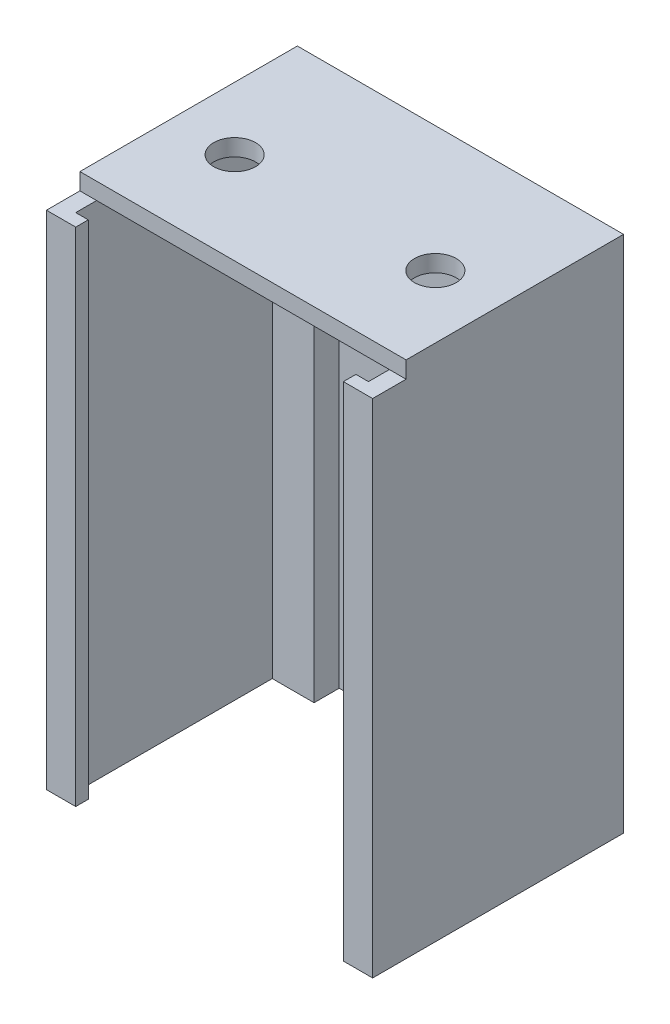
ISO-10303-21;
HEADER;
FILE_DESCRIPTION(('STEP AP214'),'2;1');
FILE_NAME('part.step','',(''),(''),'','','');
FILE_SCHEMA(('AUTOMOTIVE_DESIGN { 1 0 10303 214 1 1 1 1 }'));
ENDSEC;
DATA;
#1=APPLICATION_CONTEXT('core data for automotive mechanical design processes');
#2=APPLICATION_PROTOCOL_DEFINITION('international standard','automotive_design',2000,#1);
#3=PRODUCT_CONTEXT('',#1,'mechanical');
#4=PRODUCT('Part','Part','',(#3));
#5=PRODUCT_RELATED_PRODUCT_CATEGORY('part','',(#4));
#6=PRODUCT_DEFINITION_FORMATION('','',#4);
#7=PRODUCT_DEFINITION_CONTEXT('part definition',#1,'design');
#8=PRODUCT_DEFINITION('design','',#6,#7);
#9=PRODUCT_DEFINITION_SHAPE('','',#8);
#10=(LENGTH_UNIT() NAMED_UNIT(*) SI_UNIT(.MILLI.,.METRE.));
#11=(NAMED_UNIT(*) PLANE_ANGLE_UNIT() SI_UNIT($,.RADIAN.));
#12=(NAMED_UNIT(*) SI_UNIT($,.STERADIAN.) SOLID_ANGLE_UNIT());
#13=UNCERTAINTY_MEASURE_WITH_UNIT(LENGTH_MEASURE(1.E-05),#10,'distance_accuracy_value','');
#14=(GEOMETRIC_REPRESENTATION_CONTEXT(3) GLOBAL_UNCERTAINTY_ASSIGNED_CONTEXT((#13)) GLOBAL_UNIT_ASSIGNED_CONTEXT((#10,
#11,#12)) REPRESENTATION_CONTEXT('',''));
#15=CARTESIAN_POINT('',(0.,0.,0.));
#16=DIRECTION('',(0.,0.,1.));
#17=DIRECTION('',(1.,0.,0.));
#18=AXIS2_PLACEMENT_3D('',#15,#16,#17);
#19=CARTESIAN_POINT('',(0.,120.,0.));
#20=DIRECTION('',(0.,-1.,0.));
#21=DIRECTION('',(0.,0.,-1.));
#22=AXIS2_PLACEMENT_3D('',#19,#20,#21);
#23=PLANE('',#22);
#24=DIRECTION('',(1.,0.,0.));
#25=VECTOR('',#24,1.);
#26=CARTESIAN_POINT('',(0.,120.,52.));
#27=LINE('',#26,#25);
#28=CARTESIAN_POINT('',(0.,120.,52.));
#29=VERTEX_POINT('',#28);
#30=CARTESIAN_POINT('',(4.,120.,52.));
#31=VERTEX_POINT('',#30);
#32=EDGE_CURVE('E50',#29,#31,#27,.T.);
#33=ORIENTED_EDGE('',*,*,#32,.F.);
#34=DIRECTION('',(0.,0.,1.));
#35=VECTOR('',#34,1.);
#36=CARTESIAN_POINT('',(0.,120.,0.));
#37=LINE('',#36,#35);
#38=CARTESIAN_POINT('',(0.,120.,60.));
#39=VERTEX_POINT('',#38);
#40=EDGE_CURVE('E200',#29,#39,#37,.T.);
#41=ORIENTED_EDGE('',*,*,#40,.T.);
#42=DIRECTION('',(1.,0.,0.));
#43=VECTOR('',#42,1.);
#44=CARTESIAN_POINT('',(7.00000000000001,120.,60.));
#45=LINE('',#44,#43);
#46=CARTESIAN_POINT('',(7.00000000000001,120.,60.));
#47=VERTEX_POINT('',#46);
#48=EDGE_CURVE('E225',#39,#47,#45,.T.);
#49=ORIENTED_EDGE('',*,*,#48,.T.);
#50=DIRECTION('',(0.,0.,-1.));
#51=VECTOR('',#50,1.);
#52=CARTESIAN_POINT('',(7.00000000000001,120.,60.));
#53=LINE('',#52,#51);
#54=CARTESIAN_POINT('',(7.00000000000001,120.,57.));
#55=VERTEX_POINT('',#54);
#56=EDGE_CURVE('E229',#47,#55,#53,.T.);
#57=ORIENTED_EDGE('',*,*,#56,.T.);
#58=DIRECTION('',(-1.,0.,0.));
#59=VECTOR('',#58,1.);
#60=CARTESIAN_POINT('',(7.00000000000001,120.,57.));
#61=LINE('',#60,#59);
#62=CARTESIAN_POINT('',(3.99999999999999,120.,57.));
#63=VERTEX_POINT('',#62);
#64=EDGE_CURVE('E232',#55,#63,#61,.T.);
#65=ORIENTED_EDGE('',*,*,#64,.T.);
#66=DIRECTION('',(0.,0.,-1.));
#67=VECTOR('',#66,1.);
#68=CARTESIAN_POINT('',(3.99999999999999,120.,57.));
#69=LINE('',#68,#67);
#70=EDGE_CURVE('E235',#63,#31,#69,.T.);
#71=ORIENTED_EDGE('',*,*,#70,.T.);
#72=EDGE_LOOP('',(#33,#41,#49,#57,#65,#71));
#73=FACE_BOUND('',#72,.T.);
#74=ADVANCED_FACE('F39',(#73),#23,.F.);
#75=CARTESIAN_POINT('',(74.,120.,52.));
#76=VERTEX_POINT('',#75);
#77=CARTESIAN_POINT('',(78.,120.,52.));
#78=VERTEX_POINT('',#77);
#79=EDGE_CURVE('E11',#76,#78,#27,.T.);
#80=ORIENTED_EDGE('',*,*,#79,.F.);
#81=DIRECTION('',(0.,0.,1.));
#82=VECTOR('',#81,1.);
#83=CARTESIAN_POINT('',(74.,120.,57.));
#84=LINE('',#83,#82);
#85=CARTESIAN_POINT('',(74.,120.,57.));
#86=VERTEX_POINT('',#85);
#87=EDGE_CURVE('E258',#76,#86,#84,.T.);
#88=ORIENTED_EDGE('',*,*,#87,.T.);
#89=DIRECTION('',(-1.,0.,0.));
#90=VECTOR('',#89,1.);
#91=CARTESIAN_POINT('',(71.,120.,57.));
#92=LINE('',#91,#90);
#93=CARTESIAN_POINT('',(71.,120.,57.));
#94=VERTEX_POINT('',#93);
#95=EDGE_CURVE('E263',#86,#94,#92,.T.);
#96=ORIENTED_EDGE('',*,*,#95,.T.);
#97=DIRECTION('',(0.,0.,1.));
#98=VECTOR('',#97,1.);
#99=CARTESIAN_POINT('',(71.,120.,60.));
#100=LINE('',#99,#98);
#101=CARTESIAN_POINT('',(71.,120.,60.));
#102=VERTEX_POINT('',#101);
#103=EDGE_CURVE('E266',#94,#102,#100,.T.);
#104=ORIENTED_EDGE('',*,*,#103,.T.);
#105=DIRECTION('',(1.,0.,0.));
#106=VECTOR('',#105,1.);
#107=CARTESIAN_POINT('',(71.,120.,60.));
#108=LINE('',#107,#106);
#109=CARTESIAN_POINT('',(78.,120.,60.));
#110=VERTEX_POINT('',#109);
#111=EDGE_CURVE('E269',#102,#110,#108,.T.);
#112=ORIENTED_EDGE('',*,*,#111,.T.);
#113=DIRECTION('',(0.,0.,-1.));
#114=VECTOR('',#113,1.);
#115=CARTESIAN_POINT('',(78.,120.,0.));
#116=LINE('',#115,#114);
#117=EDGE_CURVE('E272',#110,#78,#116,.T.);
#118=ORIENTED_EDGE('',*,*,#117,.T.);
#119=EDGE_LOOP('',(#80,#88,#96,#104,#112,#118));
#120=FACE_BOUND('',#119,.T.);
#121=ADVANCED_FACE('F465',(#120),#23,.F.);
#122=CARTESIAN_POINT('',(0.,120.,0.));
#123=DIRECTION('',(1.,0.,0.));
#124=DIRECTION('',(0.,0.,-1.));
#125=AXIS2_PLACEMENT_3D('',#122,#123,#124);
#126=PLANE('',#125);
#127=DIRECTION('',(0.,0.,1.));
#128=VECTOR('',#127,1.);
#129=CARTESIAN_POINT('',(0.,0.,0.));
#130=LINE('',#129,#128);
#131=CARTESIAN_POINT('',(0.,0.,0.));
#132=VERTEX_POINT('',#131);
#133=CARTESIAN_POINT('',(0.,0.,60.));
#134=VERTEX_POINT('',#133);
#135=EDGE_CURVE('E215',#132,#134,#130,.T.);
#136=ORIENTED_EDGE('',*,*,#135,.T.);
#137=DIRECTION('',(0.,-1.,0.));
#138=VECTOR('',#137,1.);
#139=CARTESIAN_POINT('',(0.,120.,60.));
#140=LINE('',#139,#138);
#141=EDGE_CURVE('E43',#39,#134,#140,.T.);
#142=ORIENTED_EDGE('',*,*,#141,.F.);
#143=ORIENTED_EDGE('',*,*,#40,.F.);
#144=DIRECTION('',(0.,-1.,0.));
#145=VECTOR('',#144,1.);
#146=CARTESIAN_POINT('',(0.,124.,52.));
#147=LINE('',#146,#145);
#148=CARTESIAN_POINT('',(0.,124.,52.));
#149=VERTEX_POINT('',#148);
#150=EDGE_CURVE('E178',#149,#29,#147,.T.);
#151=ORIENTED_EDGE('',*,*,#150,.F.);
#152=DIRECTION('',(0.,0.,1.));
#153=VECTOR('',#152,1.);
#154=CARTESIAN_POINT('',(0.,124.,0.));
#155=LINE('',#154,#153);
#156=CARTESIAN_POINT('',(0.,124.,0.));
#157=VERTEX_POINT('',#156);
#158=EDGE_CURVE('E186',#157,#149,#155,.T.);
#159=ORIENTED_EDGE('',*,*,#158,.F.);
#160=DIRECTION('',(0.,-1.,0.));
#161=VECTOR('',#160,1.);
#162=CARTESIAN_POINT('',(0.,120.,0.));
#163=LINE('',#162,#161);
#164=EDGE_CURVE('E275',#157,#132,#163,.T.);
#165=ORIENTED_EDGE('',*,*,#164,.T.);
#166=EDGE_LOOP('',(#136,#142,#143,#151,#159,#165));
#167=FACE_BOUND('',#166,.T.);
#168=ADVANCED_FACE('F41',(#167),#126,.F.);
#169=CARTESIAN_POINT('',(7.00000000000001,120.,60.));
#170=DIRECTION('',(0.,0.,-1.));
#171=DIRECTION('',(-1.,0.,0.));
#172=AXIS2_PLACEMENT_3D('',#169,#170,#171);
#173=PLANE('',#172);
#174=DIRECTION('',(1.,0.,0.));
#175=VECTOR('',#174,1.);
#176=CARTESIAN_POINT('',(7.00000000000001,0.,60.));
#177=LINE('',#176,#175);
#178=CARTESIAN_POINT('',(7.00000000000001,0.,60.));
#179=VERTEX_POINT('',#178);
#180=EDGE_CURVE('E278',#134,#179,#177,.T.);
#181=ORIENTED_EDGE('',*,*,#180,.T.);
#182=DIRECTION('',(0.,-1.,0.));
#183=VECTOR('',#182,1.);
#184=CARTESIAN_POINT('',(7.00000000000001,120.,60.));
#185=LINE('',#184,#183);
#186=EDGE_CURVE('E375',#47,#179,#185,.T.);
#187=ORIENTED_EDGE('',*,*,#186,.F.);
#188=ORIENTED_EDGE('',*,*,#48,.F.);
#189=ORIENTED_EDGE('',*,*,#141,.T.);
#190=EDGE_LOOP('',(#181,#187,#188,#189));
#191=FACE_BOUND('',#190,.T.);
#192=ADVANCED_FACE('F386',(#191),#173,.F.);
#193=CARTESIAN_POINT('',(7.00000000000001,120.,60.));
#194=DIRECTION('',(-1.,0.,0.));
#195=DIRECTION('',(0.,0.,1.));
#196=AXIS2_PLACEMENT_3D('',#193,#194,#195);
#197=PLANE('',#196);
#198=DIRECTION('',(0.,0.,-1.));
#199=VECTOR('',#198,1.);
#200=CARTESIAN_POINT('',(7.00000000000001,0.,60.));
#201=LINE('',#200,#199);
#202=CARTESIAN_POINT('',(7.00000000000001,0.,57.));
#203=VERTEX_POINT('',#202);
#204=EDGE_CURVE('E281',#179,#203,#201,.T.);
#205=ORIENTED_EDGE('',*,*,#204,.T.);
#206=DIRECTION('',(0.,-1.,0.));
#207=VECTOR('',#206,1.);
#208=CARTESIAN_POINT('',(7.00000000000001,120.,57.));
#209=LINE('',#208,#207);
#210=EDGE_CURVE('E372',#55,#203,#209,.T.);
#211=ORIENTED_EDGE('',*,*,#210,.F.);
#212=ORIENTED_EDGE('',*,*,#56,.F.);
#213=ORIENTED_EDGE('',*,*,#186,.T.);
#214=EDGE_LOOP('',(#205,#211,#212,#213));
#215=FACE_BOUND('',#214,.T.);
#216=ADVANCED_FACE('F395',(#215),#197,.F.);
#217=CARTESIAN_POINT('',(7.00000000000001,120.,57.));
#218=DIRECTION('',(0.,0.,1.));
#219=DIRECTION('',(1.,0.,0.));
#220=AXIS2_PLACEMENT_3D('',#217,#218,#219);
#221=PLANE('',#220);
#222=DIRECTION('',(-1.,0.,0.));
#223=VECTOR('',#222,1.);
#224=CARTESIAN_POINT('',(7.00000000000001,0.,57.));
#225=LINE('',#224,#223);
#226=CARTESIAN_POINT('',(3.99999999999999,0.,57.));
#227=VERTEX_POINT('',#226);
#228=EDGE_CURVE('E284',#203,#227,#225,.T.);
#229=ORIENTED_EDGE('',*,*,#228,.T.);
#230=DIRECTION('',(0.,-1.,0.));
#231=VECTOR('',#230,1.);
#232=CARTESIAN_POINT('',(3.99999999999999,120.,57.));
#233=LINE('',#232,#231);
#234=EDGE_CURVE('E368',#63,#227,#233,.T.);
#235=ORIENTED_EDGE('',*,*,#234,.F.);
#236=ORIENTED_EDGE('',*,*,#64,.F.);
#237=ORIENTED_EDGE('',*,*,#210,.T.);
#238=EDGE_LOOP('',(#229,#235,#236,#237));
#239=FACE_BOUND('',#238,.T.);
#240=ADVANCED_FACE('F398',(#239),#221,.F.);
#241=CARTESIAN_POINT('',(3.99999999999999,120.,57.));
#242=DIRECTION('',(-1.,0.,0.));
#243=DIRECTION('',(0.,0.,1.));
#244=AXIS2_PLACEMENT_3D('',#241,#242,#243);
#245=PLANE('',#244);
#246=DIRECTION('',(0.,0.,-1.));
#247=VECTOR('',#246,1.);
#248=CARTESIAN_POINT('',(3.99999999999999,0.,57.));
#249=LINE('',#248,#247);
#250=CARTESIAN_POINT('',(4.00000000000005,0.,10.));
#251=VERTEX_POINT('',#250);
#252=EDGE_CURVE('E287',#227,#251,#249,.T.);
#253=ORIENTED_EDGE('',*,*,#252,.T.);
#254=DIRECTION('',(0.,-1.,0.));
#255=VECTOR('',#254,1.);
#256=CARTESIAN_POINT('',(4.00000000000005,120.,10.));
#257=LINE('',#256,#255);
#258=CARTESIAN_POINT('',(4.00000000000005,120.,10.));
#259=VERTEX_POINT('',#258);
#260=EDGE_CURVE('E364',#259,#251,#257,.T.);
#261=ORIENTED_EDGE('',*,*,#260,.F.);
#262=EDGE_CURVE('E64',#31,#259,#69,.T.);
#263=ORIENTED_EDGE('',*,*,#262,.F.);
#264=ORIENTED_EDGE('',*,*,#70,.F.);
#265=ORIENTED_EDGE('',*,*,#234,.T.);
#266=EDGE_LOOP('',(#253,#261,#263,#264,#265));
#267=FACE_BOUND('',#266,.T.);
#268=ADVANCED_FACE('F569',(#267),#245,.F.);
#269=CARTESIAN_POINT('',(4.00000000000005,120.,10.));
#270=DIRECTION('',(0.,0.,-1.));
#271=DIRECTION('',(-1.,0.,0.));
#272=AXIS2_PLACEMENT_3D('',#269,#270,#271);
#273=PLANE('',#272);
#274=DIRECTION('',(1.,0.,0.));
#275=VECTOR('',#274,1.);
#276=CARTESIAN_POINT('',(4.00000000000005,0.,10.));
#277=LINE('',#276,#275);
#278=CARTESIAN_POINT('',(14.,0.,10.));
#279=VERTEX_POINT('',#278);
#280=EDGE_CURVE('E290',#251,#279,#277,.T.);
#281=ORIENTED_EDGE('',*,*,#280,.T.);
#282=DIRECTION('',(0.,-1.,0.));
#283=VECTOR('',#282,1.);
#284=CARTESIAN_POINT('',(14.,120.,10.));
#285=LINE('',#284,#283);
#286=CARTESIAN_POINT('',(14.,120.,10.));
#287=VERTEX_POINT('',#286);
#288=EDGE_CURVE('E360',#287,#279,#285,.T.);
#289=ORIENTED_EDGE('',*,*,#288,.F.);
#290=DIRECTION('',(1.,0.,0.));
#291=VECTOR('',#290,1.);
#292=CARTESIAN_POINT('',(4.00000000000005,120.,10.));
#293=LINE('',#292,#291);
#294=EDGE_CURVE('E238',#259,#287,#293,.T.);
#295=ORIENTED_EDGE('',*,*,#294,.F.);
#296=ORIENTED_EDGE('',*,*,#260,.T.);
#297=EDGE_LOOP('',(#281,#289,#295,#296));
#298=FACE_BOUND('',#297,.T.);
#299=ADVANCED_FACE('F678',(#298),#273,.F.);
#300=CARTESIAN_POINT('',(14.,120.,4.));
#301=DIRECTION('',(-1.,0.,0.));
#302=DIRECTION('',(0.,0.,1.));
#303=AXIS2_PLACEMENT_3D('',#300,#301,#302);
#304=PLANE('',#303);
#305=DIRECTION('',(0.,0.,-1.));
#306=VECTOR('',#305,1.);
#307=CARTESIAN_POINT('',(14.,0.,4.));
#308=LINE('',#307,#306);
#309=CARTESIAN_POINT('',(14.,0.,4.));
#310=VERTEX_POINT('',#309);
#311=EDGE_CURVE('E293',#279,#310,#308,.T.);
#312=ORIENTED_EDGE('',*,*,#311,.T.);
#313=DIRECTION('',(0.,-1.,0.));
#314=VECTOR('',#313,1.);
#315=CARTESIAN_POINT('',(14.,120.,4.));
#316=LINE('',#315,#314);
#317=CARTESIAN_POINT('',(14.,120.,4.));
#318=VERTEX_POINT('',#317);
#319=EDGE_CURVE('E356',#318,#310,#316,.T.);
#320=ORIENTED_EDGE('',*,*,#319,.F.);
#321=DIRECTION('',(0.,0.,-1.));
#322=VECTOR('',#321,1.);
#323=CARTESIAN_POINT('',(14.,120.,4.));
#324=LINE('',#323,#322);
#325=EDGE_CURVE('E242',#287,#318,#324,.T.);
#326=ORIENTED_EDGE('',*,*,#325,.F.);
#327=ORIENTED_EDGE('',*,*,#288,.T.);
#328=EDGE_LOOP('',(#312,#320,#326,#327));
#329=FACE_BOUND('',#328,.T.);
#330=ADVANCED_FACE('F668',(#329),#304,.F.);
#331=CARTESIAN_POINT('',(14.,120.,4.));
#332=DIRECTION('',(0.,0.,-1.));
#333=DIRECTION('',(-1.,0.,0.));
#334=AXIS2_PLACEMENT_3D('',#331,#332,#333);
#335=PLANE('',#334);
#336=DIRECTION('',(1.,0.,0.));
#337=VECTOR('',#336,1.);
#338=CARTESIAN_POINT('',(14.,0.,4.));
#339=LINE('',#338,#337);
#340=CARTESIAN_POINT('',(64.,0.,3.99999999999999));
#341=VERTEX_POINT('',#340);
#342=EDGE_CURVE('E296',#310,#341,#339,.T.);
#343=ORIENTED_EDGE('',*,*,#342,.T.);
#344=DIRECTION('',(0.,-1.,0.));
#345=VECTOR('',#344,1.);
#346=CARTESIAN_POINT('',(64.,120.,3.99999999999999));
#347=LINE('',#346,#345);
#348=CARTESIAN_POINT('',(64.,120.,3.99999999999999));
#349=VERTEX_POINT('',#348);
#350=EDGE_CURVE('E352',#349,#341,#347,.T.);
#351=ORIENTED_EDGE('',*,*,#350,.F.);
#352=DIRECTION('',(1.,0.,0.));
#353=VECTOR('',#352,1.);
#354=CARTESIAN_POINT('',(14.,120.,4.));
#355=LINE('',#354,#353);
#356=EDGE_CURVE('E246',#318,#349,#355,.T.);
#357=ORIENTED_EDGE('',*,*,#356,.F.);
#358=ORIENTED_EDGE('',*,*,#319,.T.);
#359=EDGE_LOOP('',(#343,#351,#357,#358));
#360=FACE_BOUND('',#359,.T.);
#361=ADVANCED_FACE('F658',(#360),#335,.F.);
#362=CARTESIAN_POINT('',(64.,120.,3.99999999999999));
#363=DIRECTION('',(1.,0.,0.));
#364=DIRECTION('',(0.,0.,-1.));
#365=AXIS2_PLACEMENT_3D('',#362,#363,#364);
#366=PLANE('',#365);
#367=DIRECTION('',(0.,0.,1.));
#368=VECTOR('',#367,1.);
#369=CARTESIAN_POINT('',(64.,0.,3.99999999999999));
#370=LINE('',#369,#368);
#371=CARTESIAN_POINT('',(64.,0.,10.));
#372=VERTEX_POINT('',#371);
#373=EDGE_CURVE('E299',#341,#372,#370,.T.);
#374=ORIENTED_EDGE('',*,*,#373,.T.);
#375=DIRECTION('',(0.,-1.,0.));
#376=VECTOR('',#375,1.);
#377=CARTESIAN_POINT('',(64.,120.,10.));
#378=LINE('',#377,#376);
#379=CARTESIAN_POINT('',(64.,120.,10.));
#380=VERTEX_POINT('',#379);
#381=EDGE_CURVE('E348',#380,#372,#378,.T.);
#382=ORIENTED_EDGE('',*,*,#381,.F.);
#383=DIRECTION('',(0.,0.,1.));
#384=VECTOR('',#383,1.);
#385=CARTESIAN_POINT('',(64.,120.,3.99999999999999));
#386=LINE('',#385,#384);
#387=EDGE_CURVE('E250',#349,#380,#386,.T.);
#388=ORIENTED_EDGE('',*,*,#387,.F.);
#389=ORIENTED_EDGE('',*,*,#350,.T.);
#390=EDGE_LOOP('',(#374,#382,#388,#389));
#391=FACE_BOUND('',#390,.T.);
#392=ADVANCED_FACE('F648',(#391),#366,.F.);
#393=CARTESIAN_POINT('',(74.,120.,10.));
#394=DIRECTION('',(0.,0.,-1.));
#395=DIRECTION('',(-1.,0.,0.));
#396=AXIS2_PLACEMENT_3D('',#393,#394,#395);
#397=PLANE('',#396);
#398=DIRECTION('',(1.,0.,0.));
#399=VECTOR('',#398,1.);
#400=CARTESIAN_POINT('',(74.,0.,10.));
#401=LINE('',#400,#399);
#402=CARTESIAN_POINT('',(74.,0.,10.));
#403=VERTEX_POINT('',#402);
#404=EDGE_CURVE('E302',#372,#403,#401,.T.);
#405=ORIENTED_EDGE('',*,*,#404,.T.);
#406=DIRECTION('',(0.,-1.,0.));
#407=VECTOR('',#406,1.);
#408=CARTESIAN_POINT('',(74.,120.,10.));
#409=LINE('',#408,#407);
#410=CARTESIAN_POINT('',(74.,120.,10.));
#411=VERTEX_POINT('',#410);
#412=EDGE_CURVE('E344',#411,#403,#409,.T.);
#413=ORIENTED_EDGE('',*,*,#412,.F.);
#414=DIRECTION('',(1.,0.,0.));
#415=VECTOR('',#414,1.);
#416=CARTESIAN_POINT('',(74.,120.,10.));
#417=LINE('',#416,#415);
#418=EDGE_CURVE('E254',#380,#411,#417,.T.);
#419=ORIENTED_EDGE('',*,*,#418,.F.);
#420=ORIENTED_EDGE('',*,*,#381,.T.);
#421=EDGE_LOOP('',(#405,#413,#419,#420));
#422=FACE_BOUND('',#421,.T.);
#423=ADVANCED_FACE('F638',(#422),#397,.F.);
#424=CARTESIAN_POINT('',(74.,120.,57.));
#425=DIRECTION('',(1.,0.,0.));
#426=DIRECTION('',(0.,0.,-1.));
#427=AXIS2_PLACEMENT_3D('',#424,#425,#426);
#428=PLANE('',#427);
#429=DIRECTION('',(0.,0.,1.));
#430=VECTOR('',#429,1.);
#431=CARTESIAN_POINT('',(74.,0.,57.));
#432=LINE('',#431,#430);
#433=CARTESIAN_POINT('',(74.,0.,57.));
#434=VERTEX_POINT('',#433);
#435=EDGE_CURVE('E305',#403,#434,#432,.T.);
#436=ORIENTED_EDGE('',*,*,#435,.T.);
#437=DIRECTION('',(0.,-1.,0.));
#438=VECTOR('',#437,1.);
#439=CARTESIAN_POINT('',(74.,120.,57.));
#440=LINE('',#439,#438);
#441=EDGE_CURVE('E340',#86,#434,#440,.T.);
#442=ORIENTED_EDGE('',*,*,#441,.F.);
#443=ORIENTED_EDGE('',*,*,#87,.F.);
#444=EDGE_CURVE('E259',#411,#76,#84,.T.);
#445=ORIENTED_EDGE('',*,*,#444,.F.);
#446=ORIENTED_EDGE('',*,*,#412,.T.);
#447=EDGE_LOOP('',(#436,#442,#443,#445,#446));
#448=FACE_BOUND('',#447,.T.);
#449=ADVANCED_FACE('F557',(#448),#428,.F.);
#450=CARTESIAN_POINT('',(71.,120.,57.));
#451=DIRECTION('',(0.,0.,1.));
#452=DIRECTION('',(1.,0.,0.));
#453=AXIS2_PLACEMENT_3D('',#450,#451,#452);
#454=PLANE('',#453);
#455=DIRECTION('',(-1.,0.,0.));
#456=VECTOR('',#455,1.);
#457=CARTESIAN_POINT('',(71.,0.,57.));
#458=LINE('',#457,#456);
#459=CARTESIAN_POINT('',(71.,0.,57.));
#460=VERTEX_POINT('',#459);
#461=EDGE_CURVE('E308',#434,#460,#458,.T.);
#462=ORIENTED_EDGE('',*,*,#461,.T.);
#463=DIRECTION('',(0.,-1.,0.));
#464=VECTOR('',#463,1.);
#465=CARTESIAN_POINT('',(71.,120.,57.));
#466=LINE('',#465,#464);
#467=EDGE_CURVE('E336',#94,#460,#466,.T.);
#468=ORIENTED_EDGE('',*,*,#467,.F.);
#469=ORIENTED_EDGE('',*,*,#95,.F.);
#470=ORIENTED_EDGE('',*,*,#441,.T.);
#471=EDGE_LOOP('',(#462,#468,#469,#470));
#472=FACE_BOUND('',#471,.T.);
#473=ADVANCED_FACE('F547',(#472),#454,.F.);
#474=CARTESIAN_POINT('',(71.,120.,60.));
#475=DIRECTION('',(1.,0.,0.));
#476=DIRECTION('',(0.,0.,-1.));
#477=AXIS2_PLACEMENT_3D('',#474,#475,#476);
#478=PLANE('',#477);
#479=DIRECTION('',(0.,0.,1.));
#480=VECTOR('',#479,1.);
#481=CARTESIAN_POINT('',(71.,0.,60.));
#482=LINE('',#481,#480);
#483=CARTESIAN_POINT('',(71.,0.,60.));
#484=VERTEX_POINT('',#483);
#485=EDGE_CURVE('E311',#460,#484,#482,.T.);
#486=ORIENTED_EDGE('',*,*,#485,.T.);
#487=DIRECTION('',(0.,-1.,0.));
#488=VECTOR('',#487,1.);
#489=CARTESIAN_POINT('',(71.,120.,60.));
#490=LINE('',#489,#488);
#491=EDGE_CURVE('E332',#102,#484,#490,.T.);
#492=ORIENTED_EDGE('',*,*,#491,.F.);
#493=ORIENTED_EDGE('',*,*,#103,.F.);
#494=ORIENTED_EDGE('',*,*,#467,.T.);
#495=EDGE_LOOP('',(#486,#492,#493,#494));
#496=FACE_BOUND('',#495,.T.);
#497=ADVANCED_FACE('F536',(#496),#478,.F.);
#498=CARTESIAN_POINT('',(71.,120.,60.));
#499=DIRECTION('',(0.,0.,-1.));
#500=DIRECTION('',(-1.,0.,0.));
#501=AXIS2_PLACEMENT_3D('',#498,#499,#500);
#502=PLANE('',#501);
#503=DIRECTION('',(1.,0.,0.));
#504=VECTOR('',#503,1.);
#505=CARTESIAN_POINT('',(71.,0.,60.));
#506=LINE('',#505,#504);
#507=CARTESIAN_POINT('',(78.,0.,60.));
#508=VERTEX_POINT('',#507);
#509=EDGE_CURVE('E314',#484,#508,#506,.T.);
#510=ORIENTED_EDGE('',*,*,#509,.T.);
#511=DIRECTION('',(0.,-1.,0.));
#512=VECTOR('',#511,1.);
#513=CARTESIAN_POINT('',(78.,120.,60.));
#514=LINE('',#513,#512);
#515=EDGE_CURVE('E328',#110,#508,#514,.T.);
#516=ORIENTED_EDGE('',*,*,#515,.F.);
#517=ORIENTED_EDGE('',*,*,#111,.F.);
#518=ORIENTED_EDGE('',*,*,#491,.T.);
#519=EDGE_LOOP('',(#510,#516,#517,#518));
#520=FACE_BOUND('',#519,.T.);
#521=ADVANCED_FACE('F462',(#520),#502,.F.);
#522=CARTESIAN_POINT('',(78.,120.,0.));
#523=DIRECTION('',(-1.,0.,0.));
#524=DIRECTION('',(0.,0.,1.));
#525=AXIS2_PLACEMENT_3D('',#522,#523,#524);
#526=PLANE('',#525);
#527=DIRECTION('',(0.,0.,-1.));
#528=VECTOR('',#527,1.);
#529=CARTESIAN_POINT('',(78.,0.,0.));
#530=LINE('',#529,#528);
#531=CARTESIAN_POINT('',(78.,0.,0.));
#532=VERTEX_POINT('',#531);
#533=EDGE_CURVE('E317',#508,#532,#530,.T.);
#534=ORIENTED_EDGE('',*,*,#533,.T.);
#535=DIRECTION('',(0.,-1.,0.));
#536=VECTOR('',#535,1.);
#537=CARTESIAN_POINT('',(78.,120.,0.));
#538=LINE('',#537,#536);
#539=CARTESIAN_POINT('',(78.,124.,0.));
#540=VERTEX_POINT('',#539);
#541=EDGE_CURVE('E324',#540,#532,#538,.T.);
#542=ORIENTED_EDGE('',*,*,#541,.F.);
#543=DIRECTION('',(0.,0.,-1.));
#544=VECTOR('',#543,1.);
#545=CARTESIAN_POINT('',(78.,124.,0.));
#546=LINE('',#545,#544);
#547=CARTESIAN_POINT('',(78.,124.,52.));
#548=VERTEX_POINT('',#547);
#549=EDGE_CURVE('E185',#548,#540,#546,.T.);
#550=ORIENTED_EDGE('',*,*,#549,.F.);
#551=DIRECTION('',(0.,-1.,0.));
#552=VECTOR('',#551,1.);
#553=CARTESIAN_POINT('',(78.,124.,52.));
#554=LINE('',#553,#552);
#555=EDGE_CURVE('E180',#548,#78,#554,.T.);
#556=ORIENTED_EDGE('',*,*,#555,.T.);
#557=ORIENTED_EDGE('',*,*,#117,.F.);
#558=ORIENTED_EDGE('',*,*,#515,.T.);
#559=EDGE_LOOP('',(#534,#542,#550,#556,#557,#558));
#560=FACE_BOUND('',#559,.T.);
#561=ADVANCED_FACE('F450',(#560),#526,.F.);
#562=CARTESIAN_POINT('',(0.,120.,0.));
#563=DIRECTION('',(0.,0.,1.));
#564=DIRECTION('',(1.,0.,0.));
#565=AXIS2_PLACEMENT_3D('',#562,#563,#564);
#566=PLANE('',#565);
#567=DIRECTION('',(-1.,0.,0.));
#568=VECTOR('',#567,1.);
#569=CARTESIAN_POINT('',(0.,0.,0.));
#570=LINE('',#569,#568);
#571=EDGE_CURVE('E226',#532,#132,#570,.T.);
#572=ORIENTED_EDGE('',*,*,#571,.T.);
#573=ORIENTED_EDGE('',*,*,#164,.F.);
#574=DIRECTION('',(-1.,0.,0.));
#575=VECTOR('',#574,1.);
#576=CARTESIAN_POINT('',(0.,124.,0.));
#577=LINE('',#576,#575);
#578=EDGE_CURVE('E192',#540,#157,#577,.T.);
#579=ORIENTED_EDGE('',*,*,#578,.F.);
#580=ORIENTED_EDGE('',*,*,#541,.T.);
#581=EDGE_LOOP('',(#572,#573,#579,#580));
#582=FACE_BOUND('',#581,.T.);
#583=ADVANCED_FACE('F452',(#582),#566,.F.);
#584=CARTESIAN_POINT('',(0.,0.,0.));
#585=DIRECTION('',(0.,-1.,0.));
#586=DIRECTION('',(0.,0.,-1.));
#587=AXIS2_PLACEMENT_3D('',#584,#585,#586);
#588=PLANE('',#587);
#589=CARTESIAN_POINT('',(69.,0.,5.));
#590=DIRECTION('',(0.,-1.,0.));
#591=DIRECTION('',(0.,0.,-1.));
#592=AXIS2_PLACEMENT_3D('',#589,#590,#591);
#593=CIRCLE('',#592,2.25);
#594=CARTESIAN_POINT('',(69.,0.,2.75));
#595=VERTEX_POINT('',#594);
#596=EDGE_CURVE('E216',#595,#595,#593,.T.);
#597=ORIENTED_EDGE('',*,*,#596,.F.);
#598=EDGE_LOOP('',(#597));
#599=FACE_BOUND('',#598,.T.);
#600=CARTESIAN_POINT('',(9.,0.,4.99999999999999));
#601=DIRECTION('',(0.,-1.,0.));
#602=DIRECTION('',(0.,0.,-1.));
#603=AXIS2_PLACEMENT_3D('',#600,#601,#602);
#604=CIRCLE('',#603,2.25);
#605=CARTESIAN_POINT('',(9.,0.,2.74999999999998));
#606=VERTEX_POINT('',#605);
#607=EDGE_CURVE('E202',#606,#606,#604,.T.);
#608=ORIENTED_EDGE('',*,*,#607,.F.);
#609=EDGE_LOOP('',(#608));
#610=FACE_BOUND('',#609,.T.);
#611=ORIENTED_EDGE('',*,*,#135,.F.);
#612=ORIENTED_EDGE('',*,*,#571,.F.);
#613=ORIENTED_EDGE('',*,*,#533,.F.);
#614=ORIENTED_EDGE('',*,*,#509,.F.);
#615=ORIENTED_EDGE('',*,*,#485,.F.);
#616=ORIENTED_EDGE('',*,*,#461,.F.);
#617=ORIENTED_EDGE('',*,*,#435,.F.);
#618=ORIENTED_EDGE('',*,*,#404,.F.);
#619=ORIENTED_EDGE('',*,*,#373,.F.);
#620=ORIENTED_EDGE('',*,*,#342,.F.);
#621=ORIENTED_EDGE('',*,*,#311,.F.);
#622=ORIENTED_EDGE('',*,*,#280,.F.);
#623=ORIENTED_EDGE('',*,*,#252,.F.);
#624=ORIENTED_EDGE('',*,*,#228,.F.);
#625=ORIENTED_EDGE('',*,*,#204,.F.);
#626=ORIENTED_EDGE('',*,*,#180,.F.);
#627=EDGE_LOOP('',(#611,#612,#613,#614,#615,#616,#617,#618,#619,#620,#621,#622,#623,#624,#625,#626));
#628=FACE_BOUND('',#627,.T.);
#629=ADVANCED_FACE('F390',(#599,#610,#628),#588,.T.);
#630=CARTESIAN_POINT('',(9.,5.,4.99999999999999));
#631=DIRECTION('',(0.,-1.,0.));
#632=DIRECTION('',(0.,0.,-1.));
#633=AXIS2_PLACEMENT_3D('',#630,#631,#632);
#634=CYLINDRICAL_SURFACE('',#633,2.25);
#635=CARTESIAN_POINT('',(9.,5.,4.99999999999999));
#636=DIRECTION('',(0.,-1.,0.));
#637=DIRECTION('',(0.,0.,-1.));
#638=AXIS2_PLACEMENT_3D('',#635,#636,#637);
#639=CIRCLE('',#638,2.25);
#640=CARTESIAN_POINT('',(9.,5.,2.74999999999998));
#641=VERTEX_POINT('',#640);
#642=EDGE_CURVE('E207',#641,#641,#639,.T.);
#643=ORIENTED_EDGE('',*,*,#642,.F.);
#644=EDGE_LOOP('',(#643));
#645=FACE_BOUND('',#644,.T.);
#646=ORIENTED_EDGE('',*,*,#607,.T.);
#647=EDGE_LOOP('',(#646));
#648=FACE_BOUND('',#647,.T.);
#649=ADVANCED_FACE('F459',(#645,#648),#634,.F.);
#650=CARTESIAN_POINT('',(9.,5.,4.99999999999999));
#651=DIRECTION('',(0.,-1.,0.));
#652=DIRECTION('',(0.,0.,-1.));
#653=AXIS2_PLACEMENT_3D('',#650,#651,#652);
#654=PLANE('',#653);
#655=ORIENTED_EDGE('',*,*,#642,.T.);
#656=EDGE_LOOP('',(#655));
#657=FACE_BOUND('',#656,.T.);
#658=ADVANCED_FACE('F473',(#657),#654,.T.);
#659=CARTESIAN_POINT('',(69.,5.,5.));
#660=DIRECTION('',(0.,-1.,0.));
#661=DIRECTION('',(0.,0.,-1.));
#662=AXIS2_PLACEMENT_3D('',#659,#660,#661);
#663=CYLINDRICAL_SURFACE('',#662,2.25);
#664=CARTESIAN_POINT('',(69.,5.,5.));
#665=DIRECTION('',(0.,-1.,0.));
#666=DIRECTION('',(0.,0.,-1.));
#667=AXIS2_PLACEMENT_3D('',#664,#665,#666);
#668=CIRCLE('',#667,2.25);
#669=CARTESIAN_POINT('',(69.,5.,2.75));
#670=VERTEX_POINT('',#669);
#671=EDGE_CURVE('E211',#670,#670,#668,.T.);
#672=ORIENTED_EDGE('',*,*,#671,.F.);
#673=EDGE_LOOP('',(#672));
#674=FACE_BOUND('',#673,.T.);
#675=ORIENTED_EDGE('',*,*,#596,.T.);
#676=EDGE_LOOP('',(#675));
#677=FACE_BOUND('',#676,.T.);
#678=ADVANCED_FACE('F477',(#674,#677),#663,.F.);
#679=CARTESIAN_POINT('',(69.,5.,5.));
#680=DIRECTION('',(0.,-1.,0.));
#681=DIRECTION('',(0.,0.,-1.));
#682=AXIS2_PLACEMENT_3D('',#679,#680,#681);
#683=PLANE('',#682);
#684=ORIENTED_EDGE('',*,*,#671,.T.);
#685=EDGE_LOOP('',(#684));
#686=FACE_BOUND('',#685,.T.);
#687=ADVANCED_FACE('F444',(#686),#683,.T.);
#688=CARTESIAN_POINT('',(0.,120.,0.));
#689=DIRECTION('',(0.,1.,0.));
#690=DIRECTION('',(0.,0.,1.));
#691=AXIS2_PLACEMENT_3D('',#688,#689,#690);
#692=PLANE('',#691);
#693=CARTESIAN_POINT('',(15.,120.,30.));
#694=DIRECTION('',(0.,1.,0.));
#695=DIRECTION('',(0.,0.,1.));
#696=AXIS2_PLACEMENT_3D('',#693,#694,#695);
#697=CIRCLE('',#696,5.);
#698=CARTESIAN_POINT('',(15.,120.,35.));
#699=VERTEX_POINT('',#698);
#700=EDGE_CURVE('E405',#699,#699,#697,.T.);
#701=ORIENTED_EDGE('',*,*,#700,.T.);
#702=EDGE_LOOP('',(#701));
#703=FACE_BOUND('',#702,.T.);
#704=CARTESIAN_POINT('',(63.,120.,30.));
#705=DIRECTION('',(0.,1.,0.));
#706=DIRECTION('',(0.,0.,1.));
#707=AXIS2_PLACEMENT_3D('',#704,#705,#706);
#708=CIRCLE('',#707,4.99999999999999);
#709=CARTESIAN_POINT('',(63.,120.,35.));
#710=VERTEX_POINT('',#709);
#711=EDGE_CURVE('E414',#710,#710,#708,.T.);
#712=ORIENTED_EDGE('',*,*,#711,.T.);
#713=EDGE_LOOP('',(#712));
#714=FACE_BOUND('',#713,.T.);
#715=EDGE_CURVE('E51',#31,#76,#27,.T.);
#716=ORIENTED_EDGE('',*,*,#715,.F.);
#717=ORIENTED_EDGE('',*,*,#262,.T.);
#718=ORIENTED_EDGE('',*,*,#294,.T.);
#719=ORIENTED_EDGE('',*,*,#325,.T.);
#720=ORIENTED_EDGE('',*,*,#356,.T.);
#721=ORIENTED_EDGE('',*,*,#387,.T.);
#722=ORIENTED_EDGE('',*,*,#418,.T.);
#723=ORIENTED_EDGE('',*,*,#444,.T.);
#724=EDGE_LOOP('',(#716,#717,#718,#719,#720,#721,#722,#723));
#725=FACE_BOUND('',#724,.T.);
#726=ADVANCED_FACE('F441',(#703,#714,#725),#692,.F.);
#727=CARTESIAN_POINT('',(0.,124.,52.));
#728=DIRECTION('',(0.,0.,-1.));
#729=DIRECTION('',(-1.,0.,0.));
#730=AXIS2_PLACEMENT_3D('',#727,#728,#729);
#731=PLANE('',#730);
#732=ORIENTED_EDGE('',*,*,#32,.T.);
#733=ORIENTED_EDGE('',*,*,#715,.T.);
#734=ORIENTED_EDGE('',*,*,#79,.T.);
#735=ORIENTED_EDGE('',*,*,#555,.F.);
#736=DIRECTION('',(1.,0.,0.));
#737=VECTOR('',#736,1.);
#738=CARTESIAN_POINT('',(0.,124.,52.));
#739=LINE('',#738,#737);
#740=EDGE_CURVE('E173',#149,#548,#739,.T.);
#741=ORIENTED_EDGE('',*,*,#740,.F.);
#742=ORIENTED_EDGE('',*,*,#150,.T.);
#743=EDGE_LOOP('',(#732,#733,#734,#735,#741,#742));
#744=FACE_BOUND('',#743,.T.);
#745=ADVANCED_FACE('F176',(#744),#731,.F.);
#746=CARTESIAN_POINT('',(0.,124.,0.));
#747=DIRECTION('',(0.,1.,0.));
#748=DIRECTION('',(0.,0.,1.));
#749=AXIS2_PLACEMENT_3D('',#746,#747,#748);
#750=PLANE('',#749);
#751=CARTESIAN_POINT('',(15.,124.,30.));
#752=DIRECTION('',(0.,1.,0.));
#753=DIRECTION('',(0.,0.,1.));
#754=AXIS2_PLACEMENT_3D('',#751,#752,#753);
#755=CIRCLE('',#754,5.);
#756=CARTESIAN_POINT('',(15.,124.,35.));
#757=VERTEX_POINT('',#756);
#758=EDGE_CURVE('E418',#757,#757,#755,.T.);
#759=ORIENTED_EDGE('',*,*,#758,.F.);
#760=EDGE_LOOP('',(#759));
#761=FACE_BOUND('',#760,.T.);
#762=CARTESIAN_POINT('',(63.,124.,30.));
#763=DIRECTION('',(0.,1.,0.));
#764=DIRECTION('',(0.,0.,1.));
#765=AXIS2_PLACEMENT_3D('',#762,#763,#764);
#766=CIRCLE('',#765,4.99999999999999);
#767=CARTESIAN_POINT('',(63.,124.,35.));
#768=VERTEX_POINT('',#767);
#769=EDGE_CURVE('E419',#768,#768,#766,.T.);
#770=ORIENTED_EDGE('',*,*,#769,.F.);
#771=EDGE_LOOP('',(#770));
#772=FACE_BOUND('',#771,.T.);
#773=ORIENTED_EDGE('',*,*,#158,.T.);
#774=ORIENTED_EDGE('',*,*,#740,.T.);
#775=ORIENTED_EDGE('',*,*,#549,.T.);
#776=ORIENTED_EDGE('',*,*,#578,.T.);
#777=EDGE_LOOP('',(#773,#774,#775,#776));
#778=FACE_BOUND('',#777,.T.);
#779=ADVANCED_FACE('F190',(#761,#772,#778),#750,.T.);
#780=CARTESIAN_POINT('',(63.,114.,30.));
#781=DIRECTION('',(0.,1.,0.));
#782=DIRECTION('',(0.,0.,1.));
#783=AXIS2_PLACEMENT_3D('',#780,#781,#782);
#784=CYLINDRICAL_SURFACE('',#783,4.99999999999999);
#785=ORIENTED_EDGE('',*,*,#769,.T.);
#786=EDGE_LOOP('',(#785));
#787=FACE_BOUND('',#786,.T.);
#788=ORIENTED_EDGE('',*,*,#711,.F.);
#789=EDGE_LOOP('',(#788));
#790=FACE_BOUND('',#789,.T.);
#791=ADVANCED_FACE('F432',(#787,#790),#784,.F.);
#792=CARTESIAN_POINT('',(15.,114.,30.));
#793=DIRECTION('',(0.,1.,0.));
#794=DIRECTION('',(0.,0.,1.));
#795=AXIS2_PLACEMENT_3D('',#792,#793,#794);
#796=CYLINDRICAL_SURFACE('',#795,5.);
#797=ORIENTED_EDGE('',*,*,#758,.T.);
#798=EDGE_LOOP('',(#797));
#799=FACE_BOUND('',#798,.T.);
#800=ORIENTED_EDGE('',*,*,#700,.F.);
#801=EDGE_LOOP('',(#800));
#802=FACE_BOUND('',#801,.T.);
#803=ADVANCED_FACE('F427',(#799,#802),#796,.F.);
#804=CLOSED_SHELL('',(#74,#121,#168,#192,#216,#240,#268,#299,#330,#361,#392,#423,#449,#473,#497,
#521,#561,#583,#629,#649,#658,#678,#687,#726,#745,#779,#791,#803));
#805=MANIFOLD_SOLID_BREP('B2',#804);
#806=ADVANCED_BREP_SHAPE_REPRESENTATION('',(#18,#805),#14);
#807=SHAPE_DEFINITION_REPRESENTATION(#9,#806);
ENDSEC;
END-ISO-10303-21;
